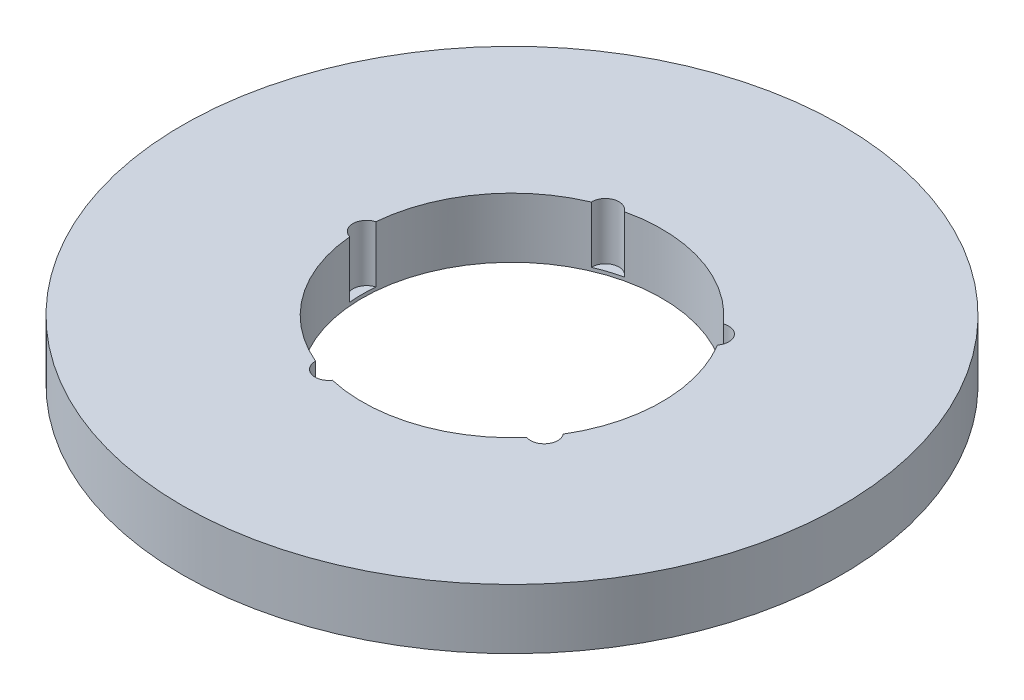
ISO-10303-21;
HEADER;
FILE_DESCRIPTION(('STEP AP214'),'2;1');
FILE_NAME('part.step','',(''),(''),'','','');
FILE_SCHEMA(('AUTOMOTIVE_DESIGN { 1 0 10303 214 1 1 1 1 }'));
ENDSEC;
DATA;
#1=APPLICATION_CONTEXT('core data for automotive mechanical design processes');
#2=APPLICATION_PROTOCOL_DEFINITION('international standard','automotive_design',2000,#1);
#3=PRODUCT_CONTEXT('',#1,'mechanical');
#4=PRODUCT('Part','Part','',(#3));
#5=PRODUCT_RELATED_PRODUCT_CATEGORY('part','',(#4));
#6=PRODUCT_DEFINITION_FORMATION('','',#4);
#7=PRODUCT_DEFINITION_CONTEXT('part definition',#1,'design');
#8=PRODUCT_DEFINITION('design','',#6,#7);
#9=PRODUCT_DEFINITION_SHAPE('','',#8);
#10=(LENGTH_UNIT() NAMED_UNIT(*) SI_UNIT(.MILLI.,.METRE.));
#11=(NAMED_UNIT(*) PLANE_ANGLE_UNIT() SI_UNIT($,.RADIAN.));
#12=(NAMED_UNIT(*) SI_UNIT($,.STERADIAN.) SOLID_ANGLE_UNIT());
#13=UNCERTAINTY_MEASURE_WITH_UNIT(LENGTH_MEASURE(1.E-05),#10,'distance_accuracy_value','');
#14=(GEOMETRIC_REPRESENTATION_CONTEXT(3) GLOBAL_UNCERTAINTY_ASSIGNED_CONTEXT((#13)) GLOBAL_UNIT_ASSIGNED_CONTEXT((#10,
#11,#12)) REPRESENTATION_CONTEXT('',''));
#15=CARTESIAN_POINT('',(0.,0.,0.));
#16=DIRECTION('',(0.,0.,1.));
#17=DIRECTION('',(1.,0.,0.));
#18=AXIS2_PLACEMENT_3D('',#15,#16,#17);
#19=CARTESIAN_POINT('',(0.,10.,0.));
#20=DIRECTION('',(0.,-1.,0.));
#21=DIRECTION('',(0.,0.,-1.));
#22=AXIS2_PLACEMENT_3D('',#19,#20,#21);
#23=CYLINDRICAL_SURFACE('',#22,55.);
#24=CARTESIAN_POINT('',(0.,10.,0.));
#25=DIRECTION('',(0.,1.,0.));
#26=DIRECTION('',(0.,0.,1.));
#27=AXIS2_PLACEMENT_3D('',#24,#25,#26);
#28=CIRCLE('',#27,55.);
#29=CARTESIAN_POINT('',(0.,10.,55.));
#30=VERTEX_POINT('',#29);
#31=EDGE_CURVE('E159',#30,#30,#28,.T.);
#32=ORIENTED_EDGE('',*,*,#31,.F.);
#33=EDGE_LOOP('',(#32));
#34=FACE_BOUND('',#33,.T.);
#35=CARTESIAN_POINT('',(0.,0.,0.));
#36=DIRECTION('',(0.,1.,0.));
#37=DIRECTION('',(0.,0.,1.));
#38=AXIS2_PLACEMENT_3D('',#35,#36,#37);
#39=CIRCLE('',#38,55.);
#40=CARTESIAN_POINT('',(0.,0.,55.));
#41=VERTEX_POINT('',#40);
#42=EDGE_CURVE('E152',#41,#41,#39,.T.);
#43=ORIENTED_EDGE('',*,*,#42,.T.);
#44=EDGE_LOOP('',(#43));
#45=FACE_BOUND('',#44,.T.);
#46=ADVANCED_FACE('F39',(#34,#45),#23,.T.);
#47=CARTESIAN_POINT('',(0.,10.,0.));
#48=DIRECTION('',(0.,1.,0.));
#49=DIRECTION('',(0.,0.,1.));
#50=AXIS2_PLACEMENT_3D('',#47,#48,#49);
#51=PLANE('',#50);
#52=CARTESIAN_POINT('',(-7.50156931187152,10.,23.0874563741263));
#53=DIRECTION('',(0.,1.,0.));
#54=DIRECTION('',(0.951056516295155,0.,0.309016994374945));
#55=AXIS2_PLACEMENT_3D('',#52,#53,#54);
#56=CIRCLE('',#55,2.2704565782524);
#57=CARTESIAN_POINT('',(-9.7707573075466,10.,23.0115688651822));
#58=VERTEX_POINT('',#57);
#59=CARTESIAN_POINT('',(-5.62115210134823,10.,24.3598573282667));
#60=VERTEX_POINT('',#59);
#61=EDGE_CURVE('E192',#58,#60,#56,.T.);
#62=ORIENTED_EDGE('',*,*,#61,.F.);
#63=CARTESIAN_POINT('',(0.,10.,0.));
#64=DIRECTION('',(0.,1.,0.));
#65=DIRECTION('',(0.,0.,1.));
#66=AXIS2_PLACEMENT_3D('',#63,#64,#65);
#67=CIRCLE('',#66,25.);
#68=CARTESIAN_POINT('',(-24.9046325753513,10.,2.18157655991001));
#69=VERTEX_POINT('',#68);
#70=EDGE_CURVE('E147',#69,#58,#67,.T.);
#71=ORIENTED_EDGE('',*,*,#70,.F.);
#72=CARTESIAN_POINT('',(-24.2755882311428,10.,0.));
#73=DIRECTION('',(0.,1.,0.));
#74=DIRECTION('',(0.,0.,1.));
#75=AXIS2_PLACEMENT_3D('',#72,#73,#74);
#76=CIRCLE('',#75,2.2704565782524);
#77=CARTESIAN_POINT('',(-24.9046325753513,10.,-2.18157655991001));
#78=VERTEX_POINT('',#77);
#79=EDGE_CURVE('E154',#78,#69,#76,.T.);
#80=ORIENTED_EDGE('',*,*,#79,.F.);
#81=CARTESIAN_POINT('',(-9.77075730754692,10.,-23.0115688651821));
#82=VERTEX_POINT('',#81);
#83=EDGE_CURVE('E136',#82,#78,#67,.T.);
#84=ORIENTED_EDGE('',*,*,#83,.F.);
#85=CARTESIAN_POINT('',(-7.50156931187184,10.,-23.0874563741262));
#86=DIRECTION('',(0.,1.,0.));
#87=DIRECTION('',(-0.95105651629515,0.,0.309016994374958));
#88=AXIS2_PLACEMENT_3D('',#85,#86,#87);
#89=CIRCLE('',#88,2.2704565782524);
#90=CARTESIAN_POINT('',(-5.62115210134857,10.,-24.3598573282666));
#91=VERTEX_POINT('',#90);
#92=EDGE_CURVE('E117',#91,#82,#89,.T.);
#93=ORIENTED_EDGE('',*,*,#92,.F.);
#94=CARTESIAN_POINT('',(18.865972463461,10.,-16.4035082530516));
#95=VERTEX_POINT('',#94);
#96=EDGE_CURVE('E133',#95,#91,#67,.T.);
#97=ORIENTED_EDGE('',*,*,#96,.F.);
#98=CARTESIAN_POINT('',(19.6393634274428,10.,-14.2688327529906));
#99=DIRECTION('',(0.,1.,0.));
#100=DIRECTION('',(-0.58778525229248,0.,-0.809016994374942));
#101=AXIS2_PLACEMENT_3D('',#98,#99,#100);
#102=CIRCLE('',#101,2.2704565782524);
#103=CARTESIAN_POINT('',(21.4305695207851,10.,-12.8736432300572));
#104=VERTEX_POINT('',#103);
#105=EDGE_CURVE('E333',#104,#95,#102,.T.);
#106=ORIENTED_EDGE('',*,*,#105,.F.);
#107=CARTESIAN_POINT('',(21.4305695207853,10.,12.8736432300569));
#108=VERTEX_POINT('',#107);
#109=EDGE_CURVE('E144',#108,#104,#67,.T.);
#110=ORIENTED_EDGE('',*,*,#109,.F.);
#111=CARTESIAN_POINT('',(19.639363427443,10.,14.2688327529903));
#112=DIRECTION('',(0.,1.,0.));
#113=DIRECTION('',(0.587785252292469,0.,-0.809016994374951));
#114=AXIS2_PLACEMENT_3D('',#111,#112,#113);
#115=CIRCLE('',#114,2.2704565782524);
#116=CARTESIAN_POINT('',(18.8659724634612,10.,16.4035082530514));
#117=VERTEX_POINT('',#116);
#118=EDGE_CURVE('E328',#117,#108,#115,.T.);
#119=ORIENTED_EDGE('',*,*,#118,.F.);
#120=EDGE_CURVE('E146',#60,#117,#67,.T.);
#121=ORIENTED_EDGE('',*,*,#120,.F.);
#122=EDGE_LOOP('',(#62,#71,#80,#84,#93,#97,#106,#110,#119,#121));
#123=FACE_BOUND('',#122,.T.);
#124=ORIENTED_EDGE('',*,*,#31,.T.);
#125=EDGE_LOOP('',(#124));
#126=FACE_BOUND('',#125,.T.);
#127=ADVANCED_FACE('F131',(#123,#126),#51,.T.);
#128=CARTESIAN_POINT('',(0.,0.,0.));
#129=DIRECTION('',(0.,1.,0.));
#130=DIRECTION('',(0.,0.,1.));
#131=AXIS2_PLACEMENT_3D('',#128,#129,#130);
#132=PLANE('',#131);
#133=CARTESIAN_POINT('',(0.,0.,0.));
#134=DIRECTION('',(0.,1.,0.));
#135=DIRECTION('',(0.,0.,1.));
#136=AXIS2_PLACEMENT_3D('',#133,#134,#135);
#137=CIRCLE('',#136,25.);
#138=CARTESIAN_POINT('',(0.,0.,25.));
#139=VERTEX_POINT('',#138);
#140=EDGE_CURVE('E149',#139,#139,#137,.T.);
#141=ORIENTED_EDGE('',*,*,#140,.T.);
#142=EDGE_LOOP('',(#141));
#143=FACE_BOUND('',#142,.T.);
#144=ORIENTED_EDGE('',*,*,#42,.F.);
#145=EDGE_LOOP('',(#144));
#146=FACE_BOUND('',#145,.T.);
#147=ADVANCED_FACE('F209',(#143,#146),#132,.F.);
#148=CARTESIAN_POINT('',(0.,10.,0.));
#149=DIRECTION('',(0.,-1.,0.));
#150=DIRECTION('',(0.,0.,-1.));
#151=AXIS2_PLACEMENT_3D('',#148,#149,#150);
#152=CYLINDRICAL_SURFACE('',#151,25.);
#153=DIRECTION('',(0.,1.,0.));
#154=VECTOR('',#153,1.);
#155=CARTESIAN_POINT('',(-9.7707573075466,5.28014410578756,23.0115688651822));
#156=LINE('',#155,#154);
#157=CARTESIAN_POINT('',(-9.7707573075466,0.560288211575132,23.0115688651822));
#158=VERTEX_POINT('',#157);
#159=EDGE_CURVE('E11',#158,#58,#156,.T.);
#160=ORIENTED_EDGE('',*,*,#159,.F.);
#161=CARTESIAN_POINT('',(0.,0.560288211575132,0.));
#162=DIRECTION('',(0.,1.,0.));
#163=DIRECTION('',(0.,0.,1.));
#164=AXIS2_PLACEMENT_3D('',#161,#162,#163);
#165=CIRCLE('',#164,25.);
#166=CARTESIAN_POINT('',(-5.62115210134823,0.560288211575132,24.3598573282667));
#167=VERTEX_POINT('',#166);
#168=EDGE_CURVE('E187',#158,#167,#165,.T.);
#169=ORIENTED_EDGE('',*,*,#168,.T.);
#170=DIRECTION('',(0.,1.,0.));
#171=VECTOR('',#170,1.);
#172=CARTESIAN_POINT('',(-5.62115210134822,5.28014410578756,24.3598573282667));
#173=LINE('',#172,#171);
#174=EDGE_CURVE('E46',#60,#167,#173,.F.);
#175=ORIENTED_EDGE('',*,*,#174,.F.);
#176=ORIENTED_EDGE('',*,*,#120,.T.);
#177=DIRECTION('',(0.,1.,0.));
#178=VECTOR('',#177,1.);
#179=CARTESIAN_POINT('',(18.8659724634612,5.28014410578756,16.4035082530514));
#180=LINE('',#179,#178);
#181=CARTESIAN_POINT('',(18.8659724634612,0.560288211575132,16.4035082530514));
#182=VERTEX_POINT('',#181);
#183=EDGE_CURVE('E186',#182,#117,#180,.T.);
#184=ORIENTED_EDGE('',*,*,#183,.F.);
#185=CARTESIAN_POINT('',(0.,0.560288211575132,0.));
#186=DIRECTION('',(0.,1.,0.));
#187=DIRECTION('',(0.,0.,1.));
#188=AXIS2_PLACEMENT_3D('',#185,#186,#187);
#189=CIRCLE('',#188,25.);
#190=CARTESIAN_POINT('',(21.4305695207853,0.560288211575132,12.8736432300569));
#191=VERTEX_POINT('',#190);
#192=EDGE_CURVE('E182',#182,#191,#189,.T.);
#193=ORIENTED_EDGE('',*,*,#192,.T.);
#194=DIRECTION('',(0.,1.,0.));
#195=VECTOR('',#194,1.);
#196=CARTESIAN_POINT('',(21.4305695207853,5.28014410578756,12.8736432300569));
#197=LINE('',#196,#195);
#198=EDGE_CURVE('E184',#108,#191,#197,.F.);
#199=ORIENTED_EDGE('',*,*,#198,.F.);
#200=ORIENTED_EDGE('',*,*,#109,.T.);
#201=DIRECTION('',(0.,1.,0.));
#202=VECTOR('',#201,1.);
#203=CARTESIAN_POINT('',(21.4305695207851,5.28014410578756,-12.8736432300572));
#204=LINE('',#203,#202);
#205=CARTESIAN_POINT('',(21.4305695207851,0.560288211575132,-12.8736432300572));
#206=VERTEX_POINT('',#205);
#207=EDGE_CURVE('E178',#206,#104,#204,.T.);
#208=ORIENTED_EDGE('',*,*,#207,.F.);
#209=CARTESIAN_POINT('',(0.,0.560288211575132,0.));
#210=DIRECTION('',(0.,1.,0.));
#211=DIRECTION('',(0.,0.,1.));
#212=AXIS2_PLACEMENT_3D('',#209,#210,#211);
#213=CIRCLE('',#212,25.);
#214=CARTESIAN_POINT('',(18.865972463461,0.560288211575132,-16.4035082530516));
#215=VERTEX_POINT('',#214);
#216=EDGE_CURVE('E123',#206,#215,#213,.T.);
#217=ORIENTED_EDGE('',*,*,#216,.T.);
#218=DIRECTION('',(0.,1.,0.));
#219=VECTOR('',#218,1.);
#220=CARTESIAN_POINT('',(18.8659724634609,5.28014410578756,-16.4035082530516));
#221=LINE('',#220,#219);
#222=EDGE_CURVE('E145',#95,#215,#221,.F.);
#223=ORIENTED_EDGE('',*,*,#222,.F.);
#224=ORIENTED_EDGE('',*,*,#96,.T.);
#225=DIRECTION('',(0.,1.,0.));
#226=VECTOR('',#225,1.);
#227=CARTESIAN_POINT('',(-5.62115210134857,5.28014410578756,-24.3598573282666));
#228=LINE('',#227,#226);
#229=CARTESIAN_POINT('',(-5.62115210134857,0.560288211575132,-24.3598573282666));
#230=VERTEX_POINT('',#229);
#231=EDGE_CURVE('E111',#230,#91,#228,.T.);
#232=ORIENTED_EDGE('',*,*,#231,.F.);
#233=CARTESIAN_POINT('',(0.,0.560288211575132,0.));
#234=DIRECTION('',(0.,1.,0.));
#235=DIRECTION('',(0.,0.,1.));
#236=AXIS2_PLACEMENT_3D('',#233,#234,#235);
#237=CIRCLE('',#236,25.);
#238=CARTESIAN_POINT('',(-9.77075730754692,0.560288211575132,-23.0115688651821));
#239=VERTEX_POINT('',#238);
#240=EDGE_CURVE('E173',#230,#239,#237,.T.);
#241=ORIENTED_EDGE('',*,*,#240,.T.);
#242=DIRECTION('',(0.,1.,0.));
#243=VECTOR('',#242,1.);
#244=CARTESIAN_POINT('',(-9.77075730754692,5.28014410578756,-23.0115688651821));
#245=LINE('',#244,#243);
#246=EDGE_CURVE('E124',#82,#239,#245,.F.);
#247=ORIENTED_EDGE('',*,*,#246,.F.);
#248=ORIENTED_EDGE('',*,*,#83,.T.);
#249=DIRECTION('',(0.,1.,0.));
#250=VECTOR('',#249,1.);
#251=CARTESIAN_POINT('',(-24.9046325753513,5.28014410578756,-2.18157655991001));
#252=LINE('',#251,#250);
#253=CARTESIAN_POINT('',(-24.9046325753513,0.560288211575132,-2.18157655991001));
#254=VERTEX_POINT('',#253);
#255=EDGE_CURVE('E171',#254,#78,#252,.T.);
#256=ORIENTED_EDGE('',*,*,#255,.F.);
#257=CARTESIAN_POINT('',(0.,0.560288211575132,0.));
#258=DIRECTION('',(0.,1.,0.));
#259=DIRECTION('',(0.,0.,1.));
#260=AXIS2_PLACEMENT_3D('',#257,#258,#259);
#261=CIRCLE('',#260,25.);
#262=CARTESIAN_POINT('',(-24.9046325753513,0.560288211575132,2.18157655991001));
#263=VERTEX_POINT('',#262);
#264=EDGE_CURVE('E162',#254,#263,#261,.T.);
#265=ORIENTED_EDGE('',*,*,#264,.T.);
#266=DIRECTION('',(0.,1.,0.));
#267=VECTOR('',#266,1.);
#268=CARTESIAN_POINT('',(-24.9046325753513,5.28014410578756,2.18157655991001));
#269=LINE('',#268,#267);
#270=EDGE_CURVE('E169',#69,#263,#269,.F.);
#271=ORIENTED_EDGE('',*,*,#270,.F.);
#272=ORIENTED_EDGE('',*,*,#70,.T.);
#273=EDGE_LOOP('',(#160,#169,#175,#176,#184,#193,#199,#200,#208,#217,#223,#224,#232,#241,#247,
#248,#256,#265,#271,#272));
#274=FACE_BOUND('',#273,.T.);
#275=ORIENTED_EDGE('',*,*,#140,.F.);
#276=EDGE_LOOP('',(#275));
#277=FACE_BOUND('',#276,.T.);
#278=ADVANCED_FACE('F139',(#274,#277),#152,.F.);
#279=CARTESIAN_POINT('',(-24.2755882311428,0.560288211575132,0.));
#280=DIRECTION('',(0.,1.,0.));
#281=DIRECTION('',(0.,0.,1.));
#282=AXIS2_PLACEMENT_3D('',#279,#280,#281);
#283=CYLINDRICAL_SURFACE('',#282,2.2704565782524);
#284=ORIENTED_EDGE('',*,*,#255,.T.);
#285=ORIENTED_EDGE('',*,*,#79,.T.);
#286=ORIENTED_EDGE('',*,*,#270,.T.);
#287=CARTESIAN_POINT('',(-24.2755882311428,0.560288211575132,0.));
#288=DIRECTION('',(0.,1.,0.));
#289=DIRECTION('',(0.,0.,1.));
#290=AXIS2_PLACEMENT_3D('',#287,#288,#289);
#291=CIRCLE('',#290,2.2704565782524);
#292=EDGE_CURVE('E157',#254,#263,#291,.T.);
#293=ORIENTED_EDGE('',*,*,#292,.F.);
#294=EDGE_LOOP('',(#284,#285,#286,#293));
#295=FACE_BOUND('',#294,.T.);
#296=ADVANCED_FACE('F222',(#295),#283,.F.);
#297=CARTESIAN_POINT('',(-24.2755882311428,0.560288211575132,0.));
#298=DIRECTION('',(0.,1.,0.));
#299=DIRECTION('',(0.,0.,1.));
#300=AXIS2_PLACEMENT_3D('',#297,#298,#299);
#301=PLANE('',#300);
#302=ORIENTED_EDGE('',*,*,#292,.T.);
#303=ORIENTED_EDGE('',*,*,#264,.F.);
#304=EDGE_LOOP('',(#302,#303));
#305=FACE_BOUND('',#304,.T.);
#306=ADVANCED_FACE('F223',(#305),#301,.T.);
#307=CARTESIAN_POINT('',(-7.50156931187184,0.560288211575132,-23.0874563741262));
#308=DIRECTION('',(0.,1.,0.));
#309=DIRECTION('',(0.,0.,1.));
#310=AXIS2_PLACEMENT_3D('',#307,#308,#309);
#311=CYLINDRICAL_SURFACE('',#310,2.2704565782524);
#312=ORIENTED_EDGE('',*,*,#231,.T.);
#313=ORIENTED_EDGE('',*,*,#92,.T.);
#314=ORIENTED_EDGE('',*,*,#246,.T.);
#315=CARTESIAN_POINT('',(-7.50156931187184,0.560288211575132,-23.0874563741262));
#316=DIRECTION('',(0.,1.,0.));
#317=DIRECTION('',(-0.95105651629515,0.,0.309016994374958));
#318=AXIS2_PLACEMENT_3D('',#315,#316,#317);
#319=CIRCLE('',#318,2.2704565782524);
#320=EDGE_CURVE('E119',#230,#239,#319,.T.);
#321=ORIENTED_EDGE('',*,*,#320,.F.);
#322=EDGE_LOOP('',(#312,#313,#314,#321));
#323=FACE_BOUND('',#322,.T.);
#324=ADVANCED_FACE('F116',(#323),#311,.F.);
#325=CARTESIAN_POINT('',(-7.50156931187184,0.560288211575132,-23.0874563741262));
#326=DIRECTION('',(0.,1.,0.));
#327=DIRECTION('',(-0.95105651629515,0.,0.309016994374958));
#328=AXIS2_PLACEMENT_3D('',#325,#326,#327);
#329=PLANE('',#328);
#330=ORIENTED_EDGE('',*,*,#320,.T.);
#331=ORIENTED_EDGE('',*,*,#240,.F.);
#332=EDGE_LOOP('',(#330,#331));
#333=FACE_BOUND('',#332,.T.);
#334=ADVANCED_FACE('F235',(#333),#329,.T.);
#335=CARTESIAN_POINT('',(19.6393634274428,0.560288211575132,-14.2688327529906));
#336=DIRECTION('',(0.,1.,0.));
#337=DIRECTION('',(0.,0.,1.));
#338=AXIS2_PLACEMENT_3D('',#335,#336,#337);
#339=CYLINDRICAL_SURFACE('',#338,2.2704565782524);
#340=ORIENTED_EDGE('',*,*,#207,.T.);
#341=ORIENTED_EDGE('',*,*,#105,.T.);
#342=ORIENTED_EDGE('',*,*,#222,.T.);
#343=CARTESIAN_POINT('',(19.6393634274428,0.560288211575132,-14.2688327529906));
#344=DIRECTION('',(0.,1.,0.));
#345=DIRECTION('',(-0.58778525229248,0.,-0.809016994374942));
#346=AXIS2_PLACEMENT_3D('',#343,#344,#345);
#347=CIRCLE('',#346,2.2704565782524);
#348=EDGE_CURVE('E335',#206,#215,#347,.T.);
#349=ORIENTED_EDGE('',*,*,#348,.F.);
#350=EDGE_LOOP('',(#340,#341,#342,#349));
#351=FACE_BOUND('',#350,.T.);
#352=ADVANCED_FACE('F234',(#351),#339,.F.);
#353=CARTESIAN_POINT('',(19.6393634274428,0.560288211575132,-14.2688327529906));
#354=DIRECTION('',(0.,1.,0.));
#355=DIRECTION('',(-0.58778525229248,0.,-0.809016994374942));
#356=AXIS2_PLACEMENT_3D('',#353,#354,#355);
#357=PLANE('',#356);
#358=ORIENTED_EDGE('',*,*,#348,.T.);
#359=ORIENTED_EDGE('',*,*,#216,.F.);
#360=EDGE_LOOP('',(#358,#359));
#361=FACE_BOUND('',#360,.T.);
#362=ADVANCED_FACE('F239',(#361),#357,.T.);
#363=CARTESIAN_POINT('',(19.639363427443,0.560288211575132,14.2688327529903));
#364=DIRECTION('',(0.,1.,0.));
#365=DIRECTION('',(0.,0.,1.));
#366=AXIS2_PLACEMENT_3D('',#363,#364,#365);
#367=CYLINDRICAL_SURFACE('',#366,2.2704565782524);
#368=ORIENTED_EDGE('',*,*,#183,.T.);
#369=ORIENTED_EDGE('',*,*,#118,.T.);
#370=ORIENTED_EDGE('',*,*,#198,.T.);
#371=CARTESIAN_POINT('',(19.639363427443,0.560288211575132,14.2688327529903));
#372=DIRECTION('',(0.,1.,0.));
#373=DIRECTION('',(0.587785252292469,0.,-0.809016994374951));
#374=AXIS2_PLACEMENT_3D('',#371,#372,#373);
#375=CIRCLE('',#374,2.2704565782524);
#376=EDGE_CURVE('E56',#182,#191,#375,.T.);
#377=ORIENTED_EDGE('',*,*,#376,.F.);
#378=EDGE_LOOP('',(#368,#369,#370,#377));
#379=FACE_BOUND('',#378,.T.);
#380=ADVANCED_FACE('F242',(#379),#367,.F.);
#381=CARTESIAN_POINT('',(19.639363427443,0.560288211575132,14.2688327529903));
#382=DIRECTION('',(0.,1.,0.));
#383=DIRECTION('',(0.587785252292469,0.,-0.809016994374951));
#384=AXIS2_PLACEMENT_3D('',#381,#382,#383);
#385=PLANE('',#384);
#386=ORIENTED_EDGE('',*,*,#376,.T.);
#387=ORIENTED_EDGE('',*,*,#192,.F.);
#388=EDGE_LOOP('',(#386,#387));
#389=FACE_BOUND('',#388,.T.);
#390=ADVANCED_FACE('F205',(#389),#385,.T.);
#391=CARTESIAN_POINT('',(-7.50156931187152,0.560288211575132,23.0874563741263));
#392=DIRECTION('',(0.,1.,0.));
#393=DIRECTION('',(0.,0.,1.));
#394=AXIS2_PLACEMENT_3D('',#391,#392,#393);
#395=CYLINDRICAL_SURFACE('',#394,2.2704565782524);
#396=ORIENTED_EDGE('',*,*,#159,.T.);
#397=ORIENTED_EDGE('',*,*,#61,.T.);
#398=ORIENTED_EDGE('',*,*,#174,.T.);
#399=CARTESIAN_POINT('',(-7.50156931187152,0.560288211575132,23.0874563741263));
#400=DIRECTION('',(0.,1.,0.));
#401=DIRECTION('',(0.951056516295155,0.,0.309016994374945));
#402=AXIS2_PLACEMENT_3D('',#399,#400,#401);
#403=CIRCLE('',#402,2.2704565782524);
#404=EDGE_CURVE('E55',#158,#167,#403,.T.);
#405=ORIENTED_EDGE('',*,*,#404,.F.);
#406=EDGE_LOOP('',(#396,#397,#398,#405));
#407=FACE_BOUND('',#406,.T.);
#408=ADVANCED_FACE('F195',(#407),#395,.F.);
#409=CARTESIAN_POINT('',(-7.50156931187152,0.560288211575132,23.0874563741263));
#410=DIRECTION('',(0.,1.,0.));
#411=DIRECTION('',(0.951056516295155,0.,0.309016994374945));
#412=AXIS2_PLACEMENT_3D('',#409,#410,#411);
#413=PLANE('',#412);
#414=ORIENTED_EDGE('',*,*,#404,.T.);
#415=ORIENTED_EDGE('',*,*,#168,.F.);
#416=EDGE_LOOP('',(#414,#415));
#417=FACE_BOUND('',#416,.T.);
#418=ADVANCED_FACE('F198',(#417),#413,.T.);
#419=CLOSED_SHELL('',(#46,#127,#147,#278,#296,#306,#324,#334,#352,#362,#380,#390,#408,#418));
#420=MANIFOLD_SOLID_BREP('B2',#419);
#421=ADVANCED_BREP_SHAPE_REPRESENTATION('',(#18,#420),#14);
#422=SHAPE_DEFINITION_REPRESENTATION(#9,#421);
ENDSEC;
END-ISO-10303-21;
